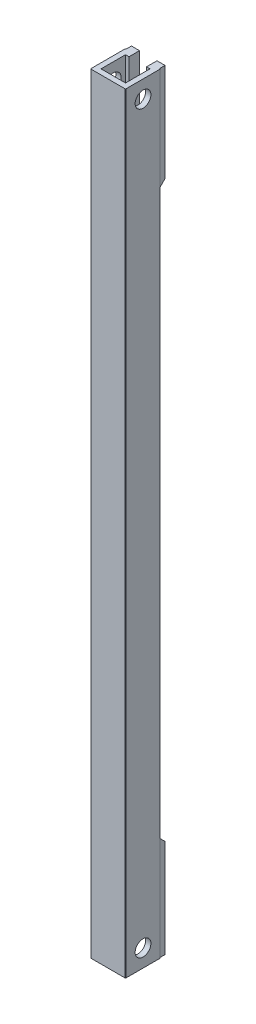
ISO-10303-21;
HEADER;
FILE_DESCRIPTION(('STEP AP214'),'2;1');
FILE_NAME('part.step','',(''),(''),'','','');
FILE_SCHEMA(('AUTOMOTIVE_DESIGN { 1 0 10303 214 1 1 1 1 }'));
ENDSEC;
DATA;
#1=APPLICATION_CONTEXT('core data for automotive mechanical design processes');
#2=APPLICATION_PROTOCOL_DEFINITION('international standard','automotive_design',2000,#1);
#3=PRODUCT_CONTEXT('',#1,'mechanical');
#4=PRODUCT('Part','Part','',(#3));
#5=PRODUCT_RELATED_PRODUCT_CATEGORY('part','',(#4));
#6=PRODUCT_DEFINITION_FORMATION('','',#4);
#7=PRODUCT_DEFINITION_CONTEXT('part definition',#1,'design');
#8=PRODUCT_DEFINITION('design','',#6,#7);
#9=PRODUCT_DEFINITION_SHAPE('','',#8);
#10=(LENGTH_UNIT() NAMED_UNIT(*) SI_UNIT(.MILLI.,.METRE.));
#11=(NAMED_UNIT(*) PLANE_ANGLE_UNIT() SI_UNIT($,.RADIAN.));
#12=(NAMED_UNIT(*) SI_UNIT($,.STERADIAN.) SOLID_ANGLE_UNIT());
#13=UNCERTAINTY_MEASURE_WITH_UNIT(LENGTH_MEASURE(1.E-05),#10,'distance_accuracy_value','');
#14=(GEOMETRIC_REPRESENTATION_CONTEXT(3) GLOBAL_UNCERTAINTY_ASSIGNED_CONTEXT((#13)) GLOBAL_UNIT_ASSIGNED_CONTEXT((#10,
#11,#12)) REPRESENTATION_CONTEXT('',''));
#15=CARTESIAN_POINT('',(0.,0.,0.));
#16=DIRECTION('',(0.,0.,1.));
#17=DIRECTION('',(1.,0.,0.));
#18=AXIS2_PLACEMENT_3D('',#15,#16,#17);
#19=CARTESIAN_POINT('',(5.,220.,-5.));
#20=DIRECTION('',(0.,0.,1.));
#21=DIRECTION('',(1.,0.,0.));
#22=AXIS2_PLACEMENT_3D('',#19,#20,#21);
#23=PLANE('',#22);
#24=DIRECTION('',(0.,-1.,0.));
#25=VECTOR('',#24,1.);
#26=CARTESIAN_POINT('',(4.8,220.,-5.));
#27=LINE('',#26,#25);
#28=CARTESIAN_POINT('',(4.8,190.5,-5.));
#29=VERTEX_POINT('',#28);
#30=CARTESIAN_POINT('',(4.8,29.5,-5.));
#31=VERTEX_POINT('',#30);
#32=EDGE_CURVE('E437',#29,#31,#27,.T.);
#33=ORIENTED_EDGE('',*,*,#32,.T.);
#34=DIRECTION('',(-1.,0.,0.));
#35=VECTOR('',#34,1.);
#36=CARTESIAN_POINT('',(-4.8,29.5,-5.));
#37=LINE('',#36,#35);
#38=CARTESIAN_POINT('',(-4.8,29.5,-5.));
#39=VERTEX_POINT('',#38);
#40=EDGE_CURVE('E446',#31,#39,#37,.T.);
#41=ORIENTED_EDGE('',*,*,#40,.T.);
#42=DIRECTION('',(0.,-1.,0.));
#43=VECTOR('',#42,1.);
#44=CARTESIAN_POINT('',(-4.8,220.,-5.));
#45=LINE('',#44,#43);
#46=CARTESIAN_POINT('',(-4.8,190.5,-5.));
#47=VERTEX_POINT('',#46);
#48=EDGE_CURVE('E440',#39,#47,#45,.F.);
#49=ORIENTED_EDGE('',*,*,#48,.T.);
#50=DIRECTION('',(1.,0.,0.));
#51=VECTOR('',#50,1.);
#52=CARTESIAN_POINT('',(5.,190.5,-5.));
#53=LINE('',#52,#51);
#54=EDGE_CURVE('E443',#47,#29,#53,.T.);
#55=ORIENTED_EDGE('',*,*,#54,.T.);
#56=EDGE_LOOP('',(#33,#41,#49,#55));
#57=FACE_BOUND('',#56,.T.);
#58=ADVANCED_FACE('F60',(#57),#23,.F.);
#59=CARTESIAN_POINT('',(0.,220.,0.));
#60=DIRECTION('',(0.,1.,0.));
#61=DIRECTION('',(0.,0.,1.));
#62=AXIS2_PLACEMENT_3D('',#59,#60,#61);
#63=PLANE('',#62);
#64=DIRECTION('',(0.,0.,-1.));
#65=VECTOR('',#64,1.);
#66=CARTESIAN_POINT('',(-2.5,220.,5.001));
#67=LINE('',#66,#65);
#68=CARTESIAN_POINT('',(-2.5,220.,-3.5));
#69=VERTEX_POINT('',#68);
#70=CARTESIAN_POINT('',(-2.5,220.,-6.5));
#71=VERTEX_POINT('',#70);
#72=EDGE_CURVE('E258',#69,#71,#67,.T.);
#73=ORIENTED_EDGE('',*,*,#72,.T.);
#74=DIRECTION('',(1.,0.,0.));
#75=VECTOR('',#74,1.);
#76=CARTESIAN_POINT('',(0.,220.,-6.5));
#77=LINE('',#76,#75);
#78=CARTESIAN_POINT('',(-4.8,220.,-6.5));
#79=VERTEX_POINT('',#78);
#80=EDGE_CURVE('E244',#79,#71,#77,.T.);
#81=ORIENTED_EDGE('',*,*,#80,.F.);
#82=DIRECTION('',(0.,0.,1.));
#83=VECTOR('',#82,1.);
#84=CARTESIAN_POINT('',(-4.8,220.,-6.5));
#85=LINE('',#84,#83);
#86=CARTESIAN_POINT('',(-4.8,220.,-5.));
#87=VERTEX_POINT('',#86);
#88=EDGE_CURVE('E250',#79,#87,#85,.T.);
#89=ORIENTED_EDGE('',*,*,#88,.T.);
#90=CARTESIAN_POINT('',(-4.8,220.,-4.8));
#91=DIRECTION('',(0.,1.,0.));
#92=DIRECTION('',(0.,0.,1.));
#93=AXIS2_PLACEMENT_3D('',#90,#91,#92);
#94=CIRCLE('',#93,0.2);
#95=CARTESIAN_POINT('',(-5.,220.,-4.8));
#96=VERTEX_POINT('',#95);
#97=EDGE_CURVE('E426',#87,#96,#94,.T.);
#98=ORIENTED_EDGE('',*,*,#97,.T.);
#99=DIRECTION('',(0.,0.,1.));
#100=VECTOR('',#99,1.);
#101=CARTESIAN_POINT('',(-5.,220.,5.));
#102=LINE('',#101,#100);
#103=CARTESIAN_POINT('',(-5.,220.,4.8));
#104=VERTEX_POINT('',#103);
#105=EDGE_CURVE('E385',#96,#104,#102,.T.);
#106=ORIENTED_EDGE('',*,*,#105,.T.);
#107=CARTESIAN_POINT('',(-4.8,220.,4.8));
#108=DIRECTION('',(0.,1.,0.));
#109=DIRECTION('',(0.,0.,1.));
#110=AXIS2_PLACEMENT_3D('',#107,#108,#109);
#111=CIRCLE('',#110,0.2);
#112=CARTESIAN_POINT('',(-4.8,220.,5.));
#113=VERTEX_POINT('',#112);
#114=EDGE_CURVE('E430',#104,#113,#111,.T.);
#115=ORIENTED_EDGE('',*,*,#114,.T.);
#116=DIRECTION('',(1.,0.,0.));
#117=VECTOR('',#116,1.);
#118=CARTESIAN_POINT('',(5.,220.,5.));
#119=LINE('',#118,#117);
#120=CARTESIAN_POINT('',(4.8,220.,5.));
#121=VERTEX_POINT('',#120);
#122=EDGE_CURVE('E388',#113,#121,#119,.T.);
#123=ORIENTED_EDGE('',*,*,#122,.T.);
#124=CARTESIAN_POINT('',(4.8,220.,4.8));
#125=DIRECTION('',(0.,1.,0.));
#126=DIRECTION('',(0.,0.,1.));
#127=AXIS2_PLACEMENT_3D('',#124,#125,#126);
#128=CIRCLE('',#127,0.2);
#129=CARTESIAN_POINT('',(5.,220.,4.8));
#130=VERTEX_POINT('',#129);
#131=EDGE_CURVE('E428',#121,#130,#128,.T.);
#132=ORIENTED_EDGE('',*,*,#131,.T.);
#133=DIRECTION('',(0.,0.,-1.));
#134=VECTOR('',#133,1.);
#135=CARTESIAN_POINT('',(5.,220.,5.));
#136=LINE('',#135,#134);
#137=CARTESIAN_POINT('',(5.,220.,-4.8));
#138=VERTEX_POINT('',#137);
#139=EDGE_CURVE('E392',#130,#138,#136,.T.);
#140=ORIENTED_EDGE('',*,*,#139,.T.);
#141=CARTESIAN_POINT('',(4.8,220.,-4.8));
#142=DIRECTION('',(0.,1.,0.));
#143=DIRECTION('',(0.,0.,1.));
#144=AXIS2_PLACEMENT_3D('',#141,#142,#143);
#145=CIRCLE('',#144,0.2);
#146=CARTESIAN_POINT('',(4.8,220.,-5.));
#147=VERTEX_POINT('',#146);
#148=EDGE_CURVE('E424',#138,#147,#145,.T.);
#149=ORIENTED_EDGE('',*,*,#148,.T.);
#150=DIRECTION('',(0.,0.,1.));
#151=VECTOR('',#150,1.);
#152=CARTESIAN_POINT('',(4.8,220.,-6.5));
#153=LINE('',#152,#151);
#154=CARTESIAN_POINT('',(4.8,220.,-6.5));
#155=VERTEX_POINT('',#154);
#156=EDGE_CURVE('E254',#155,#147,#153,.T.);
#157=ORIENTED_EDGE('',*,*,#156,.F.);
#158=CARTESIAN_POINT('',(2.5,220.,-6.5));
#159=VERTEX_POINT('',#158);
#160=EDGE_CURVE('E261',#159,#155,#77,.T.);
#161=ORIENTED_EDGE('',*,*,#160,.F.);
#162=DIRECTION('',(0.,0.,-1.));
#163=VECTOR('',#162,1.);
#164=CARTESIAN_POINT('',(2.5,220.,5.001));
#165=LINE('',#164,#163);
#166=CARTESIAN_POINT('',(2.5,220.,-3.5));
#167=VERTEX_POINT('',#166);
#168=EDGE_CURVE('E310',#167,#159,#165,.T.);
#169=ORIENTED_EDGE('',*,*,#168,.F.);
#170=DIRECTION('',(-1.,0.,0.));
#171=VECTOR('',#170,1.);
#172=CARTESIAN_POINT('',(5.,220.,-3.5));
#173=LINE('',#172,#171);
#174=CARTESIAN_POINT('',(3.5,220.,-3.5));
#175=VERTEX_POINT('',#174);
#176=EDGE_CURVE('E360',#175,#167,#173,.T.);
#177=ORIENTED_EDGE('',*,*,#176,.F.);
#178=DIRECTION('',(0.,0.,-1.));
#179=VECTOR('',#178,1.);
#180=CARTESIAN_POINT('',(3.5,220.,5.));
#181=LINE('',#180,#179);
#182=CARTESIAN_POINT('',(3.5,220.,3.5));
#183=VERTEX_POINT('',#182);
#184=EDGE_CURVE('E356',#183,#175,#181,.T.);
#185=ORIENTED_EDGE('',*,*,#184,.F.);
#186=DIRECTION('',(1.,0.,0.));
#187=VECTOR('',#186,1.);
#188=CARTESIAN_POINT('',(5.,220.,3.5));
#189=LINE('',#188,#187);
#190=CARTESIAN_POINT('',(-3.5,220.,3.5));
#191=VERTEX_POINT('',#190);
#192=EDGE_CURVE('E353',#191,#183,#189,.T.);
#193=ORIENTED_EDGE('',*,*,#192,.F.);
#194=DIRECTION('',(0.,0.,1.));
#195=VECTOR('',#194,1.);
#196=CARTESIAN_POINT('',(-3.5,220.,5.));
#197=LINE('',#196,#195);
#198=CARTESIAN_POINT('',(-3.5,220.,-3.5));
#199=VERTEX_POINT('',#198);
#200=EDGE_CURVE('E351',#199,#191,#197,.T.);
#201=ORIENTED_EDGE('',*,*,#200,.F.);
#202=EDGE_CURVE('E359',#69,#199,#173,.T.);
#203=ORIENTED_EDGE('',*,*,#202,.F.);
#204=EDGE_LOOP('',(#73,#81,#89,#98,#106,#115,#123,#132,#140,#149,#157,#161,#169,#177,#185,#193,
#201,#203));
#205=FACE_BOUND('',#204,.T.);
#206=ADVANCED_FACE('F256',(#205),#63,.T.);
#207=CARTESIAN_POINT('',(0.,0.,0.));
#208=DIRECTION('',(0.,1.,0.));
#209=DIRECTION('',(0.,0.,1.));
#210=AXIS2_PLACEMENT_3D('',#207,#208,#209);
#211=PLANE('',#210);
#212=DIRECTION('',(-1.,0.,0.));
#213=VECTOR('',#212,1.);
#214=CARTESIAN_POINT('',(5.,0.,-3.5));
#215=LINE('',#214,#213);
#216=CARTESIAN_POINT('',(3.5,0.,-3.5));
#217=VERTEX_POINT('',#216);
#218=CARTESIAN_POINT('',(2.5,0.,-3.5));
#219=VERTEX_POINT('',#218);
#220=EDGE_CURVE('E354',#217,#219,#215,.T.);
#221=ORIENTED_EDGE('',*,*,#220,.T.);
#222=DIRECTION('',(0.,0.,-1.));
#223=VECTOR('',#222,1.);
#224=CARTESIAN_POINT('',(2.5,0.,5.001));
#225=LINE('',#224,#223);
#226=CARTESIAN_POINT('',(2.5,0.,-6.5));
#227=VERTEX_POINT('',#226);
#228=EDGE_CURVE('E324',#219,#227,#225,.T.);
#229=ORIENTED_EDGE('',*,*,#228,.T.);
#230=DIRECTION('',(-1.,0.,0.));
#231=VECTOR('',#230,1.);
#232=CARTESIAN_POINT('',(0.,0.,-6.5));
#233=LINE('',#232,#231);
#234=CARTESIAN_POINT('',(4.8,0.,-6.5));
#235=VERTEX_POINT('',#234);
#236=EDGE_CURVE('E286',#235,#227,#233,.T.);
#237=ORIENTED_EDGE('',*,*,#236,.F.);
#238=DIRECTION('',(0.,0.,1.));
#239=VECTOR('',#238,1.);
#240=CARTESIAN_POINT('',(4.8,0.,-6.5));
#241=LINE('',#240,#239);
#242=CARTESIAN_POINT('',(4.8,0.,-5.));
#243=VERTEX_POINT('',#242);
#244=EDGE_CURVE('E292',#235,#243,#241,.T.);
#245=ORIENTED_EDGE('',*,*,#244,.T.);
#246=CARTESIAN_POINT('',(4.8,0.,-4.8));
#247=DIRECTION('',(0.,1.,0.));
#248=DIRECTION('',(0.,0.,1.));
#249=AXIS2_PLACEMENT_3D('',#246,#247,#248);
#250=CIRCLE('',#249,0.2);
#251=CARTESIAN_POINT('',(5.,0.,-4.8));
#252=VERTEX_POINT('',#251);
#253=EDGE_CURVE('E411',#243,#252,#250,.F.);
#254=ORIENTED_EDGE('',*,*,#253,.T.);
#255=DIRECTION('',(0.,0.,-1.));
#256=VECTOR('',#255,1.);
#257=CARTESIAN_POINT('',(5.,0.,5.));
#258=LINE('',#257,#256);
#259=CARTESIAN_POINT('',(5.,0.,4.8));
#260=VERTEX_POINT('',#259);
#261=EDGE_CURVE('E389',#260,#252,#258,.T.);
#262=ORIENTED_EDGE('',*,*,#261,.F.);
#263=CARTESIAN_POINT('',(4.8,0.,4.8));
#264=DIRECTION('',(0.,1.,0.));
#265=DIRECTION('',(0.,0.,1.));
#266=AXIS2_PLACEMENT_3D('',#263,#264,#265);
#267=CIRCLE('',#266,0.2);
#268=CARTESIAN_POINT('',(4.8,0.,5.));
#269=VERTEX_POINT('',#268);
#270=EDGE_CURVE('E415',#260,#269,#267,.F.);
#271=ORIENTED_EDGE('',*,*,#270,.T.);
#272=DIRECTION('',(1.,0.,0.));
#273=VECTOR('',#272,1.);
#274=CARTESIAN_POINT('',(5.,0.,5.));
#275=LINE('',#274,#273);
#276=CARTESIAN_POINT('',(-4.8,0.,5.));
#277=VERTEX_POINT('',#276);
#278=EDGE_CURVE('E398',#277,#269,#275,.T.);
#279=ORIENTED_EDGE('',*,*,#278,.F.);
#280=CARTESIAN_POINT('',(-4.8,0.,4.8));
#281=DIRECTION('',(0.,1.,0.));
#282=DIRECTION('',(0.,0.,1.));
#283=AXIS2_PLACEMENT_3D('',#280,#281,#282);
#284=CIRCLE('',#283,0.2);
#285=CARTESIAN_POINT('',(-5.,0.,4.8));
#286=VERTEX_POINT('',#285);
#287=EDGE_CURVE('E417',#277,#286,#284,.F.);
#288=ORIENTED_EDGE('',*,*,#287,.T.);
#289=DIRECTION('',(0.,0.,1.));
#290=VECTOR('',#289,1.);
#291=CARTESIAN_POINT('',(-5.,0.,5.));
#292=LINE('',#291,#290);
#293=CARTESIAN_POINT('',(-5.,0.,-4.8));
#294=VERTEX_POINT('',#293);
#295=EDGE_CURVE('E384',#294,#286,#292,.T.);
#296=ORIENTED_EDGE('',*,*,#295,.F.);
#297=CARTESIAN_POINT('',(-4.8,0.,-4.8));
#298=DIRECTION('',(0.,1.,0.));
#299=DIRECTION('',(0.,0.,1.));
#300=AXIS2_PLACEMENT_3D('',#297,#298,#299);
#301=CIRCLE('',#300,0.2);
#302=CARTESIAN_POINT('',(-4.8,0.,-5.));
#303=VERTEX_POINT('',#302);
#304=EDGE_CURVE('E413',#294,#303,#301,.F.);
#305=ORIENTED_EDGE('',*,*,#304,.T.);
#306=DIRECTION('',(0.,0.,1.));
#307=VECTOR('',#306,1.);
#308=CARTESIAN_POINT('',(-4.8,0.,-6.5));
#309=LINE('',#308,#307);
#310=CARTESIAN_POINT('',(-4.8,0.,-6.5));
#311=VERTEX_POINT('',#310);
#312=EDGE_CURVE('E297',#311,#303,#309,.T.);
#313=ORIENTED_EDGE('',*,*,#312,.F.);
#314=CARTESIAN_POINT('',(-2.5,0.,-6.5));
#315=VERTEX_POINT('',#314);
#316=EDGE_CURVE('E284',#315,#311,#233,.T.);
#317=ORIENTED_EDGE('',*,*,#316,.F.);
#318=DIRECTION('',(0.,0.,-1.));
#319=VECTOR('',#318,1.);
#320=CARTESIAN_POINT('',(-2.5,0.,5.001));
#321=LINE('',#320,#319);
#322=CARTESIAN_POINT('',(-2.5,0.,-3.5));
#323=VERTEX_POINT('',#322);
#324=EDGE_CURVE('E322',#323,#315,#321,.T.);
#325=ORIENTED_EDGE('',*,*,#324,.F.);
#326=CARTESIAN_POINT('',(-3.5,0.,-3.5));
#327=VERTEX_POINT('',#326);
#328=EDGE_CURVE('E372',#323,#327,#215,.T.);
#329=ORIENTED_EDGE('',*,*,#328,.T.);
#330=DIRECTION('',(0.,0.,1.));
#331=VECTOR('',#330,1.);
#332=CARTESIAN_POINT('',(-3.5,0.,5.));
#333=LINE('',#332,#331);
#334=CARTESIAN_POINT('',(-3.5,0.,3.5));
#335=VERTEX_POINT('',#334);
#336=EDGE_CURVE('E350',#327,#335,#333,.T.);
#337=ORIENTED_EDGE('',*,*,#336,.T.);
#338=DIRECTION('',(1.,0.,0.));
#339=VECTOR('',#338,1.);
#340=CARTESIAN_POINT('',(5.,0.,3.5));
#341=LINE('',#340,#339);
#342=CARTESIAN_POINT('',(3.5,0.,3.5));
#343=VERTEX_POINT('',#342);
#344=EDGE_CURVE('E366',#335,#343,#341,.T.);
#345=ORIENTED_EDGE('',*,*,#344,.T.);
#346=DIRECTION('',(0.,0.,-1.));
#347=VECTOR('',#346,1.);
#348=CARTESIAN_POINT('',(3.5,0.,5.));
#349=LINE('',#348,#347);
#350=EDGE_CURVE('E369',#343,#217,#349,.T.);
#351=ORIENTED_EDGE('',*,*,#350,.T.);
#352=EDGE_LOOP('',(#221,#229,#237,#245,#254,#262,#271,#279,#288,#296,#305,#313,#317,#325,#329,
#337,#345,#351));
#353=FACE_BOUND('',#352,.T.);
#354=ADVANCED_FACE('F478',(#353),#211,.F.);
#355=CARTESIAN_POINT('',(-5.,220.,5.));
#356=DIRECTION('',(1.,0.,0.));
#357=DIRECTION('',(0.,0.,-1.));
#358=AXIS2_PLACEMENT_3D('',#355,#356,#357);
#359=PLANE('',#358);
#360=CARTESIAN_POINT('',(-5.,215.,0.));
#361=DIRECTION('',(1.,0.,0.));
#362=DIRECTION('',(0.,0.,-1.));
#363=AXIS2_PLACEMENT_3D('',#360,#361,#362);
#364=CIRCLE('',#363,2.25);
#365=CARTESIAN_POINT('',(-5.,215.,-2.25));
#366=VERTEX_POINT('',#365);
#367=EDGE_CURVE('E334',#366,#366,#364,.T.);
#368=ORIENTED_EDGE('',*,*,#367,.T.);
#369=EDGE_LOOP('',(#368));
#370=FACE_BOUND('',#369,.T.);
#371=CARTESIAN_POINT('',(-5.,5.,0.));
#372=DIRECTION('',(1.,0.,0.));
#373=DIRECTION('',(0.,0.,1.));
#374=AXIS2_PLACEMENT_3D('',#371,#372,#373);
#375=CIRCLE('',#374,2.25);
#376=CARTESIAN_POINT('',(-5.,5.,2.25));
#377=VERTEX_POINT('',#376);
#378=EDGE_CURVE('E335',#377,#377,#375,.T.);
#379=ORIENTED_EDGE('',*,*,#378,.T.);
#380=EDGE_LOOP('',(#379));
#381=FACE_BOUND('',#380,.T.);
#382=ORIENTED_EDGE('',*,*,#295,.T.);
#383=DIRECTION('',(0.,-1.,0.));
#384=VECTOR('',#383,1.);
#385=CARTESIAN_POINT('',(-5.,220.,4.8));
#386=LINE('',#385,#384);
#387=EDGE_CURVE('E422',#286,#104,#386,.F.);
#388=ORIENTED_EDGE('',*,*,#387,.T.);
#389=ORIENTED_EDGE('',*,*,#105,.F.);
#390=DIRECTION('',(0.,-1.,0.));
#391=VECTOR('',#390,1.);
#392=CARTESIAN_POINT('',(-5.,220.,-4.8));
#393=LINE('',#392,#391);
#394=EDGE_CURVE('E419',#96,#294,#393,.T.);
#395=ORIENTED_EDGE('',*,*,#394,.T.);
#396=EDGE_LOOP('',(#382,#388,#389,#395));
#397=FACE_BOUND('',#396,.T.);
#398=ADVANCED_FACE('F484',(#370,#381,#397),#359,.F.);
#399=CARTESIAN_POINT('',(5.,220.,5.));
#400=DIRECTION('',(0.,0.,-1.));
#401=DIRECTION('',(-1.,0.,0.));
#402=AXIS2_PLACEMENT_3D('',#399,#400,#401);
#403=PLANE('',#402);
#404=ORIENTED_EDGE('',*,*,#122,.F.);
#405=DIRECTION('',(0.,-1.,0.));
#406=VECTOR('',#405,1.);
#407=CARTESIAN_POINT('',(-4.8,220.,5.));
#408=LINE('',#407,#406);
#409=EDGE_CURVE('E408',#113,#277,#408,.T.);
#410=ORIENTED_EDGE('',*,*,#409,.T.);
#411=ORIENTED_EDGE('',*,*,#278,.T.);
#412=DIRECTION('',(0.,-1.,0.));
#413=VECTOR('',#412,1.);
#414=CARTESIAN_POINT('',(4.8,220.,5.));
#415=LINE('',#414,#413);
#416=EDGE_CURVE('E395',#269,#121,#415,.F.);
#417=ORIENTED_EDGE('',*,*,#416,.T.);
#418=EDGE_LOOP('',(#404,#410,#411,#417));
#419=FACE_BOUND('',#418,.T.);
#420=ADVANCED_FACE('F493',(#419),#403,.F.);
#421=CARTESIAN_POINT('',(5.,220.,5.));
#422=DIRECTION('',(-1.,0.,0.));
#423=DIRECTION('',(0.,0.,1.));
#424=AXIS2_PLACEMENT_3D('',#421,#422,#423);
#425=PLANE('',#424);
#426=CARTESIAN_POINT('',(5.,215.,0.));
#427=DIRECTION('',(1.,0.,0.));
#428=DIRECTION('',(0.,0.,-1.));
#429=AXIS2_PLACEMENT_3D('',#426,#427,#428);
#430=CIRCLE('',#429,2.25);
#431=CARTESIAN_POINT('',(5.,215.,-2.25));
#432=VERTEX_POINT('',#431);
#433=EDGE_CURVE('E331',#432,#432,#430,.T.);
#434=ORIENTED_EDGE('',*,*,#433,.F.);
#435=EDGE_LOOP('',(#434));
#436=FACE_BOUND('',#435,.T.);
#437=CARTESIAN_POINT('',(5.,5.,0.));
#438=DIRECTION('',(1.,0.,0.));
#439=DIRECTION('',(0.,0.,1.));
#440=AXIS2_PLACEMENT_3D('',#437,#438,#439);
#441=CIRCLE('',#440,2.25);
#442=CARTESIAN_POINT('',(5.,5.,2.25));
#443=VERTEX_POINT('',#442);
#444=EDGE_CURVE('E316',#443,#443,#441,.T.);
#445=ORIENTED_EDGE('',*,*,#444,.F.);
#446=EDGE_LOOP('',(#445));
#447=FACE_BOUND('',#446,.T.);
#448=ORIENTED_EDGE('',*,*,#139,.F.);
#449=DIRECTION('',(0.,-1.,0.));
#450=VECTOR('',#449,1.);
#451=CARTESIAN_POINT('',(5.,220.,4.8));
#452=LINE('',#451,#450);
#453=EDGE_CURVE('E434',#130,#260,#452,.T.);
#454=ORIENTED_EDGE('',*,*,#453,.T.);
#455=ORIENTED_EDGE('',*,*,#261,.T.);
#456=DIRECTION('',(0.,-1.,0.));
#457=VECTOR('',#456,1.);
#458=CARTESIAN_POINT('',(5.,220.,-4.8));
#459=LINE('',#458,#457);
#460=EDGE_CURVE('E432',#252,#138,#459,.F.);
#461=ORIENTED_EDGE('',*,*,#460,.T.);
#462=EDGE_LOOP('',(#448,#454,#455,#461));
#463=FACE_BOUND('',#462,.T.);
#464=ADVANCED_FACE('F501',(#436,#447,#463),#425,.F.);
#465=CARTESIAN_POINT('',(-3.5,220.,5.));
#466=DIRECTION('',(1.,0.,0.));
#467=DIRECTION('',(0.,0.,-1.));
#468=AXIS2_PLACEMENT_3D('',#465,#466,#467);
#469=PLANE('',#468);
#470=CARTESIAN_POINT('',(-3.5,215.,0.));
#471=DIRECTION('',(1.,0.,0.));
#472=DIRECTION('',(0.,0.,-1.));
#473=AXIS2_PLACEMENT_3D('',#470,#471,#472);
#474=CIRCLE('',#473,2.25);
#475=CARTESIAN_POINT('',(-3.5,215.,-2.25));
#476=VERTEX_POINT('',#475);
#477=EDGE_CURVE('E347',#476,#476,#474,.T.);
#478=ORIENTED_EDGE('',*,*,#477,.F.);
#479=EDGE_LOOP('',(#478));
#480=FACE_BOUND('',#479,.T.);
#481=CARTESIAN_POINT('',(-3.5,5.,0.));
#482=DIRECTION('',(1.,0.,0.));
#483=DIRECTION('',(0.,0.,-1.));
#484=AXIS2_PLACEMENT_3D('',#481,#482,#483);
#485=CIRCLE('',#484,2.25);
#486=CARTESIAN_POINT('',(-3.5,5.,-2.25));
#487=VERTEX_POINT('',#486);
#488=EDGE_CURVE('E343',#487,#487,#485,.T.);
#489=ORIENTED_EDGE('',*,*,#488,.F.);
#490=EDGE_LOOP('',(#489));
#491=FACE_BOUND('',#490,.T.);
#492=ORIENTED_EDGE('',*,*,#336,.F.);
#493=DIRECTION('',(0.,-1.,0.));
#494=VECTOR('',#493,1.);
#495=CARTESIAN_POINT('',(-3.5,220.,-3.5));
#496=LINE('',#495,#494);
#497=EDGE_CURVE('E363',#199,#327,#496,.T.);
#498=ORIENTED_EDGE('',*,*,#497,.F.);
#499=ORIENTED_EDGE('',*,*,#200,.T.);
#500=DIRECTION('',(0.,-1.,0.));
#501=VECTOR('',#500,1.);
#502=CARTESIAN_POINT('',(-3.5,220.,3.5));
#503=LINE('',#502,#501);
#504=EDGE_CURVE('E381',#191,#335,#503,.T.);
#505=ORIENTED_EDGE('',*,*,#504,.T.);
#506=EDGE_LOOP('',(#492,#498,#499,#505));
#507=FACE_BOUND('',#506,.T.);
#508=ADVANCED_FACE('F526',(#480,#491,#507),#469,.T.);
#509=CARTESIAN_POINT('',(5.,220.,3.5));
#510=DIRECTION('',(0.,0.,-1.));
#511=DIRECTION('',(-1.,0.,0.));
#512=AXIS2_PLACEMENT_3D('',#509,#510,#511);
#513=PLANE('',#512);
#514=ORIENTED_EDGE('',*,*,#344,.F.);
#515=ORIENTED_EDGE('',*,*,#504,.F.);
#516=ORIENTED_EDGE('',*,*,#192,.T.);
#517=DIRECTION('',(0.,-1.,0.));
#518=VECTOR('',#517,1.);
#519=CARTESIAN_POINT('',(3.5,220.,3.5));
#520=LINE('',#519,#518);
#521=EDGE_CURVE('E379',#183,#343,#520,.T.);
#522=ORIENTED_EDGE('',*,*,#521,.T.);
#523=EDGE_LOOP('',(#514,#515,#516,#522));
#524=FACE_BOUND('',#523,.T.);
#525=ADVANCED_FACE('F523',(#524),#513,.T.);
#526=CARTESIAN_POINT('',(3.5,220.,5.));
#527=DIRECTION('',(-1.,0.,0.));
#528=DIRECTION('',(0.,0.,1.));
#529=AXIS2_PLACEMENT_3D('',#526,#527,#528);
#530=PLANE('',#529);
#531=CARTESIAN_POINT('',(3.5,215.,0.));
#532=DIRECTION('',(-1.,0.,0.));
#533=DIRECTION('',(0.,0.,1.));
#534=AXIS2_PLACEMENT_3D('',#531,#532,#533);
#535=CIRCLE('',#534,2.25);
#536=CARTESIAN_POINT('',(3.5,215.,2.25));
#537=VERTEX_POINT('',#536);
#538=EDGE_CURVE('E346',#537,#537,#535,.T.);
#539=ORIENTED_EDGE('',*,*,#538,.F.);
#540=EDGE_LOOP('',(#539));
#541=FACE_BOUND('',#540,.T.);
#542=CARTESIAN_POINT('',(3.5,5.,0.));
#543=DIRECTION('',(-1.,0.,0.));
#544=DIRECTION('',(0.,0.,1.));
#545=AXIS2_PLACEMENT_3D('',#542,#543,#544);
#546=CIRCLE('',#545,2.25);
#547=CARTESIAN_POINT('',(3.5,5.,2.25));
#548=VERTEX_POINT('',#547);
#549=EDGE_CURVE('E338',#548,#548,#546,.T.);
#550=ORIENTED_EDGE('',*,*,#549,.F.);
#551=EDGE_LOOP('',(#550));
#552=FACE_BOUND('',#551,.T.);
#553=ORIENTED_EDGE('',*,*,#350,.F.);
#554=ORIENTED_EDGE('',*,*,#521,.F.);
#555=ORIENTED_EDGE('',*,*,#184,.T.);
#556=DIRECTION('',(0.,-1.,0.));
#557=VECTOR('',#556,1.);
#558=CARTESIAN_POINT('',(3.5,220.,-3.5));
#559=LINE('',#558,#557);
#560=EDGE_CURVE('E377',#175,#217,#559,.T.);
#561=ORIENTED_EDGE('',*,*,#560,.T.);
#562=EDGE_LOOP('',(#553,#554,#555,#561));
#563=FACE_BOUND('',#562,.T.);
#564=ADVANCED_FACE('F518',(#541,#552,#563),#530,.T.);
#565=CARTESIAN_POINT('',(5.,220.,-3.5));
#566=DIRECTION('',(0.,0.,1.));
#567=DIRECTION('',(1.,0.,0.));
#568=AXIS2_PLACEMENT_3D('',#565,#566,#567);
#569=PLANE('',#568);
#570=DIRECTION('',(0.,1.,0.));
#571=VECTOR('',#570,1.);
#572=CARTESIAN_POINT('',(-2.5,0.,-3.5));
#573=LINE('',#572,#571);
#574=CARTESIAN_POINT('',(-2.5,195.,-3.5));
#575=VERTEX_POINT('',#574);
#576=EDGE_CURVE('E307',#575,#69,#573,.T.);
#577=ORIENTED_EDGE('',*,*,#576,.T.);
#578=ORIENTED_EDGE('',*,*,#202,.T.);
#579=ORIENTED_EDGE('',*,*,#497,.T.);
#580=ORIENTED_EDGE('',*,*,#328,.F.);
#581=DIRECTION('',(0.,-1.,0.));
#582=VECTOR('',#581,1.);
#583=CARTESIAN_POINT('',(-2.5,0.,-3.5));
#584=LINE('',#583,#582);
#585=CARTESIAN_POINT('',(-2.5,25.,-3.5));
#586=VERTEX_POINT('',#585);
#587=EDGE_CURVE('E319',#586,#323,#584,.T.);
#588=ORIENTED_EDGE('',*,*,#587,.F.);
#589=DIRECTION('',(1.,0.,0.));
#590=VECTOR('',#589,1.);
#591=CARTESIAN_POINT('',(0.,25.,-3.5));
#592=LINE('',#591,#590);
#593=CARTESIAN_POINT('',(2.5,25.,-3.5));
#594=VERTEX_POINT('',#593);
#595=EDGE_CURVE('E304',#586,#594,#592,.T.);
#596=ORIENTED_EDGE('',*,*,#595,.T.);
#597=DIRECTION('',(0.,-1.,0.));
#598=VECTOR('',#597,1.);
#599=CARTESIAN_POINT('',(2.5,0.,-3.5));
#600=LINE('',#599,#598);
#601=EDGE_CURVE('E300',#594,#219,#600,.T.);
#602=ORIENTED_EDGE('',*,*,#601,.T.);
#603=ORIENTED_EDGE('',*,*,#220,.F.);
#604=ORIENTED_EDGE('',*,*,#560,.F.);
#605=ORIENTED_EDGE('',*,*,#176,.T.);
#606=DIRECTION('',(0.,1.,0.));
#607=VECTOR('',#606,1.);
#608=CARTESIAN_POINT('',(2.5,0.,-3.5));
#609=LINE('',#608,#607);
#610=CARTESIAN_POINT('',(2.5,195.,-3.5));
#611=VERTEX_POINT('',#610);
#612=EDGE_CURVE('E303',#611,#167,#609,.T.);
#613=ORIENTED_EDGE('',*,*,#612,.F.);
#614=DIRECTION('',(1.,0.,0.));
#615=VECTOR('',#614,1.);
#616=CARTESIAN_POINT('',(0.,195.,-3.5));
#617=LINE('',#616,#615);
#618=EDGE_CURVE('E301',#575,#611,#617,.T.);
#619=ORIENTED_EDGE('',*,*,#618,.F.);
#620=EDGE_LOOP('',(#577,#578,#579,#580,#588,#596,#602,#603,#604,#605,#613,#619));
#621=FACE_BOUND('',#620,.T.);
#622=ADVANCED_FACE('F512',(#621),#569,.T.);
#623=CARTESIAN_POINT('',(-5.,5.,0.));
#624=DIRECTION('',(1.,0.,0.));
#625=DIRECTION('',(0.,0.,-1.));
#626=AXIS2_PLACEMENT_3D('',#623,#624,#625);
#627=CYLINDRICAL_SURFACE('',#626,2.25);
#628=ORIENTED_EDGE('',*,*,#549,.T.);
#629=EDGE_LOOP('',(#628));
#630=FACE_BOUND('',#629,.T.);
#631=ORIENTED_EDGE('',*,*,#444,.T.);
#632=EDGE_LOOP('',(#631));
#633=FACE_BOUND('',#632,.T.);
#634=ADVANCED_FACE('F606',(#630,#633),#627,.F.);
#635=CARTESIAN_POINT('',(-5.,215.,0.));
#636=DIRECTION('',(1.,0.,0.));
#637=DIRECTION('',(0.,0.,-1.));
#638=AXIS2_PLACEMENT_3D('',#635,#636,#637);
#639=CYLINDRICAL_SURFACE('',#638,2.25);
#640=ORIENTED_EDGE('',*,*,#538,.T.);
#641=EDGE_LOOP('',(#640));
#642=FACE_BOUND('',#641,.T.);
#643=ORIENTED_EDGE('',*,*,#433,.T.);
#644=EDGE_LOOP('',(#643));
#645=FACE_BOUND('',#644,.T.);
#646=ADVANCED_FACE('F602',(#642,#645),#639,.F.);
#647=ORIENTED_EDGE('',*,*,#488,.T.);
#648=EDGE_LOOP('',(#647));
#649=FACE_BOUND('',#648,.T.);
#650=ORIENTED_EDGE('',*,*,#378,.F.);
#651=EDGE_LOOP('',(#650));
#652=FACE_BOUND('',#651,.T.);
#653=ADVANCED_FACE('F605',(#649,#652),#627,.F.);
#654=ORIENTED_EDGE('',*,*,#477,.T.);
#655=EDGE_LOOP('',(#654));
#656=FACE_BOUND('',#655,.T.);
#657=ORIENTED_EDGE('',*,*,#367,.F.);
#658=EDGE_LOOP('',(#657));
#659=FACE_BOUND('',#658,.T.);
#660=ADVANCED_FACE('F568',(#656,#659),#639,.F.);
#661=CARTESIAN_POINT('',(-4.8,220.,4.8));
#662=DIRECTION('',(0.,-1.,0.));
#663=DIRECTION('',(0.,0.,-1.));
#664=AXIS2_PLACEMENT_3D('',#661,#662,#663);
#665=CYLINDRICAL_SURFACE('',#664,0.2);
#666=ORIENTED_EDGE('',*,*,#114,.F.);
#667=ORIENTED_EDGE('',*,*,#387,.F.);
#668=ORIENTED_EDGE('',*,*,#287,.F.);
#669=ORIENTED_EDGE('',*,*,#409,.F.);
#670=EDGE_LOOP('',(#666,#667,#668,#669));
#671=FACE_BOUND('',#670,.T.);
#672=ADVANCED_FACE('F488',(#671),#665,.T.);
#673=CARTESIAN_POINT('',(4.8,220.,4.8));
#674=DIRECTION('',(0.,-1.,0.));
#675=DIRECTION('',(0.,0.,-1.));
#676=AXIS2_PLACEMENT_3D('',#673,#674,#675);
#677=CYLINDRICAL_SURFACE('',#676,0.2);
#678=ORIENTED_EDGE('',*,*,#131,.F.);
#679=ORIENTED_EDGE('',*,*,#416,.F.);
#680=ORIENTED_EDGE('',*,*,#270,.F.);
#681=ORIENTED_EDGE('',*,*,#453,.F.);
#682=EDGE_LOOP('',(#678,#679,#680,#681));
#683=FACE_BOUND('',#682,.T.);
#684=ADVANCED_FACE('F496',(#683),#677,.T.);
#685=CARTESIAN_POINT('',(-4.8,220.,-4.8));
#686=DIRECTION('',(0.,-1.,0.));
#687=DIRECTION('',(0.,0.,-1.));
#688=AXIS2_PLACEMENT_3D('',#685,#686,#687);
#689=CYLINDRICAL_SURFACE('',#688,0.2);
#690=ORIENTED_EDGE('',*,*,#97,.F.);
#691=DIRECTION('',(0.,1.,0.));
#692=VECTOR('',#691,1.);
#693=CARTESIAN_POINT('',(-4.8,0.,-5.));
#694=LINE('',#693,#692);
#695=EDGE_CURVE('E102',#47,#87,#694,.T.);
#696=ORIENTED_EDGE('',*,*,#695,.F.);
#697=ORIENTED_EDGE('',*,*,#48,.F.);
#698=EDGE_CURVE('E441',#303,#39,#45,.F.);
#699=ORIENTED_EDGE('',*,*,#698,.F.);
#700=ORIENTED_EDGE('',*,*,#304,.F.);
#701=ORIENTED_EDGE('',*,*,#394,.F.);
#702=EDGE_LOOP('',(#690,#696,#697,#699,#700,#701));
#703=FACE_BOUND('',#702,.T.);
#704=ADVANCED_FACE('F470',(#703),#689,.T.);
#705=CARTESIAN_POINT('',(4.8,220.,-4.8));
#706=DIRECTION('',(0.,-1.,0.));
#707=DIRECTION('',(0.,0.,-1.));
#708=AXIS2_PLACEMENT_3D('',#705,#706,#707);
#709=CYLINDRICAL_SURFACE('',#708,0.2);
#710=ORIENTED_EDGE('',*,*,#148,.F.);
#711=ORIENTED_EDGE('',*,*,#460,.F.);
#712=ORIENTED_EDGE('',*,*,#253,.F.);
#713=DIRECTION('',(0.,-1.,0.));
#714=VECTOR('',#713,1.);
#715=CARTESIAN_POINT('',(4.8,0.,-5.));
#716=LINE('',#715,#714);
#717=EDGE_CURVE('E253',#31,#243,#716,.T.);
#718=ORIENTED_EDGE('',*,*,#717,.F.);
#719=ORIENTED_EDGE('',*,*,#32,.F.);
#720=EDGE_CURVE('E438',#147,#29,#27,.T.);
#721=ORIENTED_EDGE('',*,*,#720,.F.);
#722=EDGE_LOOP('',(#710,#711,#712,#718,#719,#721));
#723=FACE_BOUND('',#722,.T.);
#724=ADVANCED_FACE('F505',(#723),#709,.T.);
#725=CARTESIAN_POINT('',(0.,25.,5.001));
#726=DIRECTION('',(0.,1.,0.));
#727=DIRECTION('',(0.,0.,1.));
#728=AXIS2_PLACEMENT_3D('',#725,#726,#727);
#729=PLANE('',#728);
#730=DIRECTION('',(0.,0.,-1.));
#731=VECTOR('',#730,1.);
#732=CARTESIAN_POINT('',(-2.5,25.,5.001));
#733=LINE('',#732,#731);
#734=CARTESIAN_POINT('',(-2.5,25.,-6.5));
#735=VERTEX_POINT('',#734);
#736=EDGE_CURVE('E321',#586,#735,#733,.T.);
#737=ORIENTED_EDGE('',*,*,#736,.T.);
#738=DIRECTION('',(1.,0.,0.));
#739=VECTOR('',#738,1.);
#740=CARTESIAN_POINT('',(0.,25.,-6.5));
#741=LINE('',#740,#739);
#742=CARTESIAN_POINT('',(2.5,25.,-6.5));
#743=VERTEX_POINT('',#742);
#744=EDGE_CURVE('E278',#735,#743,#741,.T.);
#745=ORIENTED_EDGE('',*,*,#744,.T.);
#746=DIRECTION('',(0.,0.,-1.));
#747=VECTOR('',#746,1.);
#748=CARTESIAN_POINT('',(2.5,25.,5.001));
#749=LINE('',#748,#747);
#750=EDGE_CURVE('E326',#594,#743,#749,.T.);
#751=ORIENTED_EDGE('',*,*,#750,.F.);
#752=ORIENTED_EDGE('',*,*,#595,.F.);
#753=EDGE_LOOP('',(#737,#745,#751,#752));
#754=FACE_BOUND('',#753,.T.);
#755=ADVANCED_FACE('F574',(#754),#729,.F.);
#756=CARTESIAN_POINT('',(2.5,0.,5.001));
#757=DIRECTION('',(1.,0.,0.));
#758=DIRECTION('',(0.,0.,-1.));
#759=AXIS2_PLACEMENT_3D('',#756,#757,#758);
#760=PLANE('',#759);
#761=ORIENTED_EDGE('',*,*,#750,.T.);
#762=DIRECTION('',(0.,-1.,0.));
#763=VECTOR('',#762,1.);
#764=CARTESIAN_POINT('',(2.5,0.,-6.5));
#765=LINE('',#764,#763);
#766=EDGE_CURVE('E289',#743,#227,#765,.T.);
#767=ORIENTED_EDGE('',*,*,#766,.T.);
#768=ORIENTED_EDGE('',*,*,#228,.F.);
#769=ORIENTED_EDGE('',*,*,#601,.F.);
#770=EDGE_LOOP('',(#761,#767,#768,#769));
#771=FACE_BOUND('',#770,.T.);
#772=ADVANCED_FACE('F546',(#771),#760,.F.);
#773=CARTESIAN_POINT('',(-2.5,0.,5.001));
#774=DIRECTION('',(1.,0.,0.));
#775=DIRECTION('',(0.,0.,-1.));
#776=AXIS2_PLACEMENT_3D('',#773,#774,#775);
#777=PLANE('',#776);
#778=ORIENTED_EDGE('',*,*,#587,.T.);
#779=ORIENTED_EDGE('',*,*,#324,.T.);
#780=DIRECTION('',(0.,-1.,0.));
#781=VECTOR('',#780,1.);
#782=CARTESIAN_POINT('',(-2.5,0.,-6.5));
#783=LINE('',#782,#781);
#784=EDGE_CURVE('E281',#735,#315,#783,.T.);
#785=ORIENTED_EDGE('',*,*,#784,.F.);
#786=ORIENTED_EDGE('',*,*,#736,.F.);
#787=EDGE_LOOP('',(#778,#779,#785,#786));
#788=FACE_BOUND('',#787,.T.);
#789=ADVANCED_FACE('F539',(#788),#777,.T.);
#790=CARTESIAN_POINT('',(0.,195.,5.001));
#791=DIRECTION('',(0.,1.,0.));
#792=DIRECTION('',(0.,0.,1.));
#793=AXIS2_PLACEMENT_3D('',#790,#791,#792);
#794=PLANE('',#793);
#795=ORIENTED_EDGE('',*,*,#618,.T.);
#796=DIRECTION('',(0.,0.,-1.));
#797=VECTOR('',#796,1.);
#798=CARTESIAN_POINT('',(2.5,195.,5.001));
#799=LINE('',#798,#797);
#800=CARTESIAN_POINT('',(2.5,195.,-6.5));
#801=VERTEX_POINT('',#800);
#802=EDGE_CURVE('E312',#611,#801,#799,.T.);
#803=ORIENTED_EDGE('',*,*,#802,.T.);
#804=DIRECTION('',(1.,0.,0.));
#805=VECTOR('',#804,1.);
#806=CARTESIAN_POINT('',(0.,195.,-6.5));
#807=LINE('',#806,#805);
#808=CARTESIAN_POINT('',(-2.5,195.,-6.5));
#809=VERTEX_POINT('',#808);
#810=EDGE_CURVE('E262',#809,#801,#807,.T.);
#811=ORIENTED_EDGE('',*,*,#810,.F.);
#812=DIRECTION('',(0.,0.,-1.));
#813=VECTOR('',#812,1.);
#814=CARTESIAN_POINT('',(-2.5,195.,5.001));
#815=LINE('',#814,#813);
#816=EDGE_CURVE('E306',#575,#809,#815,.T.);
#817=ORIENTED_EDGE('',*,*,#816,.F.);
#818=EDGE_LOOP('',(#795,#803,#811,#817));
#819=FACE_BOUND('',#818,.T.);
#820=ADVANCED_FACE('F537',(#819),#794,.T.);
#821=CARTESIAN_POINT('',(-2.5,0.,5.001));
#822=DIRECTION('',(-1.,0.,0.));
#823=DIRECTION('',(0.,0.,1.));
#824=AXIS2_PLACEMENT_3D('',#821,#822,#823);
#825=PLANE('',#824);
#826=ORIENTED_EDGE('',*,*,#816,.T.);
#827=DIRECTION('',(0.,1.,0.));
#828=VECTOR('',#827,1.);
#829=CARTESIAN_POINT('',(-2.5,0.,-6.5));
#830=LINE('',#829,#828);
#831=EDGE_CURVE('E259',#809,#71,#830,.T.);
#832=ORIENTED_EDGE('',*,*,#831,.T.);
#833=ORIENTED_EDGE('',*,*,#72,.F.);
#834=ORIENTED_EDGE('',*,*,#576,.F.);
#835=EDGE_LOOP('',(#826,#832,#833,#834));
#836=FACE_BOUND('',#835,.T.);
#837=ADVANCED_FACE('F532',(#836),#825,.F.);
#838=CARTESIAN_POINT('',(2.5,0.,5.001));
#839=DIRECTION('',(-1.,0.,0.));
#840=DIRECTION('',(0.,0.,1.));
#841=AXIS2_PLACEMENT_3D('',#838,#839,#840);
#842=PLANE('',#841);
#843=ORIENTED_EDGE('',*,*,#612,.T.);
#844=ORIENTED_EDGE('',*,*,#168,.T.);
#845=DIRECTION('',(0.,1.,0.));
#846=VECTOR('',#845,1.);
#847=CARTESIAN_POINT('',(2.5,0.,-6.5));
#848=LINE('',#847,#846);
#849=EDGE_CURVE('E265',#801,#159,#848,.T.);
#850=ORIENTED_EDGE('',*,*,#849,.F.);
#851=ORIENTED_EDGE('',*,*,#802,.F.);
#852=EDGE_LOOP('',(#843,#844,#850,#851));
#853=FACE_BOUND('',#852,.T.);
#854=ADVANCED_FACE('F536',(#853),#842,.T.);
#855=CARTESIAN_POINT('',(-4.8,0.,-6.5));
#856=DIRECTION('',(1.,0.,0.));
#857=DIRECTION('',(0.,0.,-1.));
#858=AXIS2_PLACEMENT_3D('',#855,#856,#857);
#859=PLANE('',#858);
#860=ORIENTED_EDGE('',*,*,#698,.T.);
#861=DIRECTION('',(0.,0.707106781186542,0.707106781186553));
#862=VECTOR('',#861,1.);
#863=CARTESIAN_POINT('',(-4.8,14.0000000000002,-20.5));
#864=LINE('',#863,#862);
#865=CARTESIAN_POINT('',(-4.8,28.,-6.5));
#866=VERTEX_POINT('',#865);
#867=EDGE_CURVE('E453',#39,#866,#864,.F.);
#868=ORIENTED_EDGE('',*,*,#867,.T.);
#869=DIRECTION('',(0.,1.,0.));
#870=VECTOR('',#869,1.);
#871=CARTESIAN_POINT('',(-4.8,0.,-6.5));
#872=LINE('',#871,#870);
#873=EDGE_CURVE('E87',#311,#866,#872,.T.);
#874=ORIENTED_EDGE('',*,*,#873,.F.);
#875=ORIENTED_EDGE('',*,*,#312,.T.);
#876=EDGE_LOOP('',(#860,#868,#874,#875));
#877=FACE_BOUND('',#876,.T.);
#878=ADVANCED_FACE('F475',(#877),#859,.F.);
#879=CARTESIAN_POINT('',(4.8,0.,-6.5));
#880=DIRECTION('',(-1.,0.,0.));
#881=DIRECTION('',(0.,0.,1.));
#882=AXIS2_PLACEMENT_3D('',#879,#880,#881);
#883=PLANE('',#882);
#884=ORIENTED_EDGE('',*,*,#717,.T.);
#885=ORIENTED_EDGE('',*,*,#244,.F.);
#886=DIRECTION('',(0.,-1.,0.));
#887=VECTOR('',#886,1.);
#888=CARTESIAN_POINT('',(4.8,0.,-6.5));
#889=LINE('',#888,#887);
#890=CARTESIAN_POINT('',(4.8,28.,-6.5));
#891=VERTEX_POINT('',#890);
#892=EDGE_CURVE('E95',#891,#235,#889,.T.);
#893=ORIENTED_EDGE('',*,*,#892,.F.);
#894=DIRECTION('',(0.,-0.707106781186542,-0.707106781186553));
#895=VECTOR('',#894,1.);
#896=CARTESIAN_POINT('',(4.8,14.0000000000002,-20.5));
#897=LINE('',#896,#895);
#898=EDGE_CURVE('E451',#891,#31,#897,.F.);
#899=ORIENTED_EDGE('',*,*,#898,.T.);
#900=EDGE_LOOP('',(#884,#885,#893,#899));
#901=FACE_BOUND('',#900,.T.);
#902=ADVANCED_FACE('F590',(#901),#883,.F.);
#903=CARTESIAN_POINT('',(0.,0.,-6.5));
#904=DIRECTION('',(0.,0.,-1.));
#905=DIRECTION('',(-1.,0.,0.));
#906=AXIS2_PLACEMENT_3D('',#903,#904,#905);
#907=PLANE('',#906);
#908=ORIENTED_EDGE('',*,*,#744,.F.);
#909=ORIENTED_EDGE('',*,*,#784,.T.);
#910=ORIENTED_EDGE('',*,*,#316,.T.);
#911=ORIENTED_EDGE('',*,*,#873,.T.);
#912=DIRECTION('',(-1.,0.,0.));
#913=VECTOR('',#912,1.);
#914=CARTESIAN_POINT('',(0.,28.,-6.5));
#915=LINE('',#914,#913);
#916=EDGE_CURVE('E449',#866,#891,#915,.F.);
#917=ORIENTED_EDGE('',*,*,#916,.T.);
#918=ORIENTED_EDGE('',*,*,#892,.T.);
#919=ORIENTED_EDGE('',*,*,#236,.T.);
#920=ORIENTED_EDGE('',*,*,#766,.F.);
#921=EDGE_LOOP('',(#908,#909,#910,#911,#917,#918,#919,#920));
#922=FACE_BOUND('',#921,.T.);
#923=ADVANCED_FACE('F586',(#922),#907,.T.);
#924=CARTESIAN_POINT('',(-4.8,0.,-6.5));
#925=DIRECTION('',(1.,0.,0.));
#926=DIRECTION('',(0.,0.,-1.));
#927=AXIS2_PLACEMENT_3D('',#924,#925,#926);
#928=PLANE('',#927);
#929=ORIENTED_EDGE('',*,*,#695,.T.);
#930=ORIENTED_EDGE('',*,*,#88,.F.);
#931=DIRECTION('',(0.,1.,0.));
#932=VECTOR('',#931,1.);
#933=CARTESIAN_POINT('',(-4.8,0.,-6.5));
#934=LINE('',#933,#932);
#935=CARTESIAN_POINT('',(-4.8,192.,-6.5));
#936=VERTEX_POINT('',#935);
#937=EDGE_CURVE('E75',#936,#79,#934,.T.);
#938=ORIENTED_EDGE('',*,*,#937,.F.);
#939=DIRECTION('',(0.,-0.70710678118655,0.707106781186545));
#940=VECTOR('',#939,1.);
#941=CARTESIAN_POINT('',(-4.79999999999999,95.9999999999993,89.5));
#942=LINE('',#941,#940);
#943=EDGE_CURVE('E12',#936,#47,#942,.T.);
#944=ORIENTED_EDGE('',*,*,#943,.T.);
#945=EDGE_LOOP('',(#929,#930,#938,#944));
#946=FACE_BOUND('',#945,.T.);
#947=ADVANCED_FACE('F251',(#946),#928,.F.);
#948=CARTESIAN_POINT('',(4.8,0.,-6.5));
#949=DIRECTION('',(-1.,0.,0.));
#950=DIRECTION('',(0.,0.,1.));
#951=AXIS2_PLACEMENT_3D('',#948,#949,#950);
#952=PLANE('',#951);
#953=ORIENTED_EDGE('',*,*,#720,.T.);
#954=DIRECTION('',(0.,0.70710678118655,-0.707106781186545));
#955=VECTOR('',#954,1.);
#956=CARTESIAN_POINT('',(4.80000000000001,95.9999999999993,89.5));
#957=LINE('',#956,#955);
#958=CARTESIAN_POINT('',(4.8,192.,-6.5));
#959=VERTEX_POINT('',#958);
#960=EDGE_CURVE('E455',#29,#959,#957,.T.);
#961=ORIENTED_EDGE('',*,*,#960,.T.);
#962=DIRECTION('',(0.,-1.,0.));
#963=VECTOR('',#962,1.);
#964=CARTESIAN_POINT('',(4.8,0.,-6.5));
#965=LINE('',#964,#963);
#966=EDGE_CURVE('E264',#155,#959,#965,.T.);
#967=ORIENTED_EDGE('',*,*,#966,.F.);
#968=ORIENTED_EDGE('',*,*,#156,.T.);
#969=EDGE_LOOP('',(#953,#961,#967,#968));
#970=FACE_BOUND('',#969,.T.);
#971=ADVANCED_FACE('F460',(#970),#952,.F.);
#972=CARTESIAN_POINT('',(0.,0.,-6.5));
#973=DIRECTION('',(0.,0.,-1.));
#974=DIRECTION('',(-1.,0.,0.));
#975=AXIS2_PLACEMENT_3D('',#972,#973,#974);
#976=PLANE('',#975);
#977=ORIENTED_EDGE('',*,*,#966,.T.);
#978=DIRECTION('',(-1.,0.,0.));
#979=VECTOR('',#978,1.);
#980=CARTESIAN_POINT('',(5.,192.,-6.5));
#981=LINE('',#980,#979);
#982=EDGE_CURVE('E69',#959,#936,#981,.T.);
#983=ORIENTED_EDGE('',*,*,#982,.T.);
#984=ORIENTED_EDGE('',*,*,#937,.T.);
#985=ORIENTED_EDGE('',*,*,#80,.T.);
#986=ORIENTED_EDGE('',*,*,#831,.F.);
#987=ORIENTED_EDGE('',*,*,#810,.T.);
#988=ORIENTED_EDGE('',*,*,#849,.T.);
#989=ORIENTED_EDGE('',*,*,#160,.T.);
#990=EDGE_LOOP('',(#977,#983,#984,#985,#986,#987,#988,#989));
#991=FACE_BOUND('',#990,.T.);
#992=ADVANCED_FACE('F241',(#991),#976,.T.);
#993=CARTESIAN_POINT('',(0.,27.5,-7.00000000000004));
#994=DIRECTION('',(0.,0.707106781186553,-0.707106781186542));
#995=DIRECTION('',(-1.,0.,0.));
#996=AXIS2_PLACEMENT_3D('',#993,#994,#995);
#997=PLANE('',#996);
#998=ORIENTED_EDGE('',*,*,#867,.F.);
#999=ORIENTED_EDGE('',*,*,#40,.F.);
#1000=ORIENTED_EDGE('',*,*,#898,.F.);
#1001=ORIENTED_EDGE('',*,*,#916,.F.);
#1002=EDGE_LOOP('',(#998,#999,#1000,#1001));
#1003=FACE_BOUND('',#1002,.T.);
#1004=ADVANCED_FACE('F575',(#1003),#997,.T.);
#1005=CARTESIAN_POINT('',(5.,190.5,-5.));
#1006=DIRECTION('',(0.,0.707106781186545,0.70710678118655));
#1007=DIRECTION('',(1.,0.,0.));
#1008=AXIS2_PLACEMENT_3D('',#1005,#1006,#1007);
#1009=PLANE('',#1008);
#1010=ORIENTED_EDGE('',*,*,#943,.F.);
#1011=ORIENTED_EDGE('',*,*,#982,.F.);
#1012=ORIENTED_EDGE('',*,*,#960,.F.);
#1013=ORIENTED_EDGE('',*,*,#54,.F.);
#1014=EDGE_LOOP('',(#1010,#1011,#1012,#1013));
#1015=FACE_BOUND('',#1014,.T.);
#1016=ADVANCED_FACE('F62',(#1015),#1009,.F.);
#1017=CLOSED_SHELL('',(#58,#206,#354,#398,#420,#464,#508,#525,#564,#622,#634,#646,#653,#660,
#672,#684,#704,#724,#755,#772,#789,#820,#837,#854,#878,#902,#923,#947,#971,#992,#1004,#1016));
#1018=MANIFOLD_SOLID_BREP('B2',#1017);
#1019=ADVANCED_BREP_SHAPE_REPRESENTATION('',(#18,#1018),#14);
#1020=SHAPE_DEFINITION_REPRESENTATION(#9,#1019);
ENDSEC;
END-ISO-10303-21;
